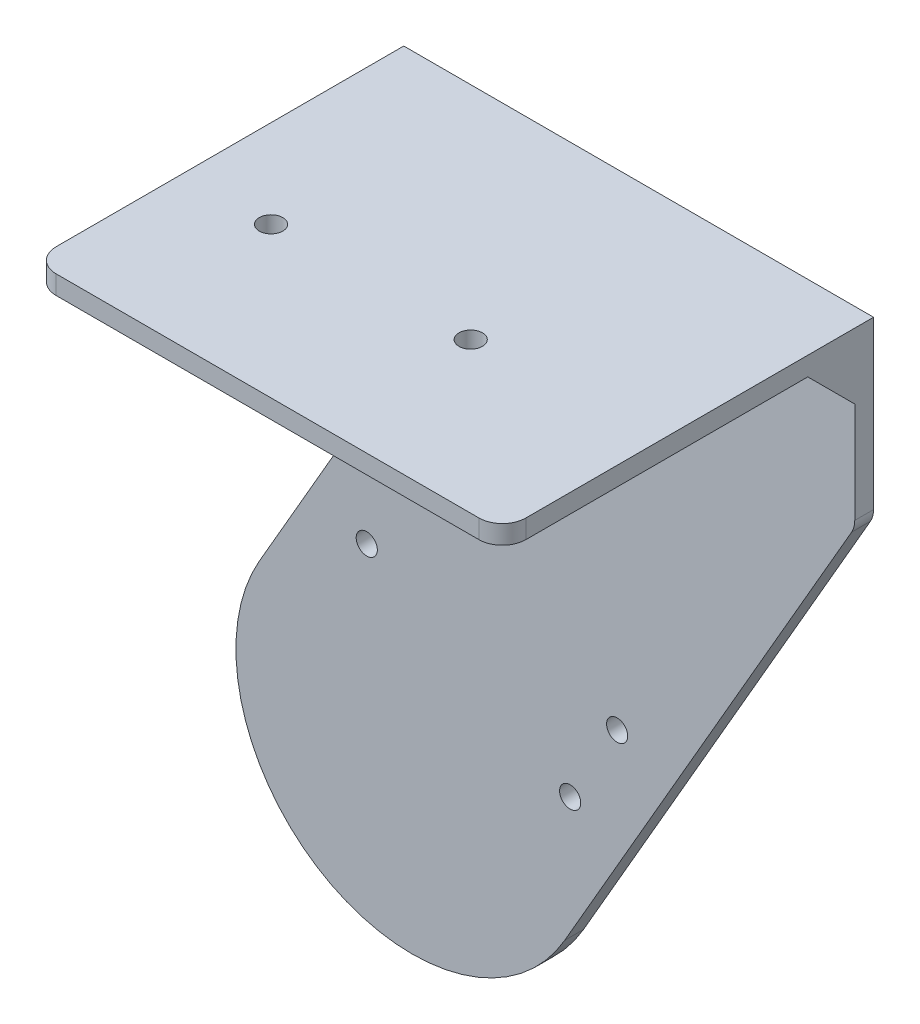
ISO-10303-21;
HEADER;
FILE_DESCRIPTION(('STEP AP214'),'2;1');
FILE_NAME('part.step','',(''),(''),'','','');
FILE_SCHEMA(('AUTOMOTIVE_DESIGN { 1 0 10303 214 1 1 1 1 }'));
ENDSEC;
DATA;
#1=APPLICATION_CONTEXT('core data for automotive mechanical design processes');
#2=APPLICATION_PROTOCOL_DEFINITION('international standard','automotive_design',2000,#1);
#3=PRODUCT_CONTEXT('',#1,'mechanical');
#4=PRODUCT('Part','Part','',(#3));
#5=PRODUCT_RELATED_PRODUCT_CATEGORY('part','',(#4));
#6=PRODUCT_DEFINITION_FORMATION('','',#4);
#7=PRODUCT_DEFINITION_CONTEXT('part definition',#1,'design');
#8=PRODUCT_DEFINITION('design','',#6,#7);
#9=PRODUCT_DEFINITION_SHAPE('','',#8);
#10=(LENGTH_UNIT() NAMED_UNIT(*) SI_UNIT(.MILLI.,.METRE.));
#11=(NAMED_UNIT(*) PLANE_ANGLE_UNIT() SI_UNIT($,.RADIAN.));
#12=(NAMED_UNIT(*) SI_UNIT($,.STERADIAN.) SOLID_ANGLE_UNIT());
#13=UNCERTAINTY_MEASURE_WITH_UNIT(LENGTH_MEASURE(1.E-05),#10,'distance_accuracy_value','');
#14=(GEOMETRIC_REPRESENTATION_CONTEXT(3) GLOBAL_UNCERTAINTY_ASSIGNED_CONTEXT((#13)) GLOBAL_UNIT_ASSIGNED_CONTEXT((#10,
#11,#12)) REPRESENTATION_CONTEXT('',''));
#15=CARTESIAN_POINT('',(0.,0.,0.));
#16=DIRECTION('',(0.,0.,1.));
#17=DIRECTION('',(1.,0.,0.));
#18=AXIS2_PLACEMENT_3D('',#15,#16,#17);
#19=CARTESIAN_POINT('',(0.,0.,8.));
#20=DIRECTION('',(0.,0.,-1.));
#21=DIRECTION('',(-1.,0.,0.));
#22=AXIS2_PLACEMENT_3D('',#19,#20,#21);
#23=CYLINDRICAL_SURFACE('',#22,75.);
#24=CARTESIAN_POINT('',(0.,0.,0.));
#25=DIRECTION('',(0.,0.,1.));
#26=DIRECTION('',(-1.,0.,0.));
#27=AXIS2_PLACEMENT_3D('',#24,#25,#26);
#28=CIRCLE('',#27,75.);
#29=CARTESIAN_POINT('',(-64.9519052838328,37.5,0.));
#30=VERTEX_POINT('',#29);
#31=CARTESIAN_POINT('',(64.9519052838328,-37.5000000000001,0.));
#32=VERTEX_POINT('',#31);
#33=EDGE_CURVE('E157',#30,#32,#28,.T.);
#34=ORIENTED_EDGE('',*,*,#33,.T.);
#35=DIRECTION('',(0.,0.,-1.));
#36=VECTOR('',#35,1.);
#37=CARTESIAN_POINT('',(64.9519052838328,-37.5000000000001,8.));
#38=LINE('',#37,#36);
#39=CARTESIAN_POINT('',(64.9519052838328,-37.5000000000001,8.));
#40=VERTEX_POINT('',#39);
#41=EDGE_CURVE('E138',#40,#32,#38,.T.);
#42=ORIENTED_EDGE('',*,*,#41,.F.);
#43=CARTESIAN_POINT('',(0.,0.,8.));
#44=DIRECTION('',(0.,0.,1.));
#45=DIRECTION('',(-1.,0.,0.));
#46=AXIS2_PLACEMENT_3D('',#43,#44,#45);
#47=CIRCLE('',#46,75.);
#48=CARTESIAN_POINT('',(-64.9519052838328,37.5,8.));
#49=VERTEX_POINT('',#48);
#50=EDGE_CURVE('E145',#49,#40,#47,.T.);
#51=ORIENTED_EDGE('',*,*,#50,.F.);
#52=DIRECTION('',(0.,0.,-1.));
#53=VECTOR('',#52,1.);
#54=CARTESIAN_POINT('',(-64.9519052838328,37.5,8.));
#55=LINE('',#54,#53);
#56=EDGE_CURVE('E225',#49,#30,#55,.T.);
#57=ORIENTED_EDGE('',*,*,#56,.T.);
#58=EDGE_LOOP('',(#34,#42,#51,#57));
#59=FACE_BOUND('',#58,.T.);
#60=ADVANCED_FACE('F36',(#59),#23,.T.);
#61=CARTESIAN_POINT('',(64.9519052838328,-37.5000000000001,8.));
#62=DIRECTION('',(-0.866025403784438,0.500000000000001,0.));
#63=DIRECTION('',(-0.500000000000001,-0.866025403784438,0.));
#64=AXIS2_PLACEMENT_3D('',#61,#62,#63);
#65=PLANE('',#64);
#66=DIRECTION('',(0.500000000000001,0.866025403784438,0.));
#67=VECTOR('',#66,1.);
#68=CARTESIAN_POINT('',(64.9519052838328,-37.5000000000001,0.));
#69=LINE('',#68,#67);
#70=CARTESIAN_POINT('',(187.113248654052,174.089653438086,0.));
#71=VERTEX_POINT('',#70);
#72=EDGE_CURVE('E232',#32,#71,#69,.T.);
#73=ORIENTED_EDGE('',*,*,#72,.T.);
#74=DIRECTION('',(0.,0.,-1.));
#75=VECTOR('',#74,1.);
#76=CARTESIAN_POINT('',(187.113248654052,174.089653438086,8.));
#77=LINE('',#76,#75);
#78=CARTESIAN_POINT('',(187.113248654052,174.089653438086,8.));
#79=VERTEX_POINT('',#78);
#80=EDGE_CURVE('E141',#71,#79,#77,.F.);
#81=ORIENTED_EDGE('',*,*,#80,.T.);
#82=DIRECTION('',(0.500000000000001,0.866025403784438,0.));
#83=VECTOR('',#82,1.);
#84=CARTESIAN_POINT('',(64.9519052838328,-37.5000000000001,8.));
#85=LINE('',#84,#83);
#86=EDGE_CURVE('E133',#40,#79,#85,.T.);
#87=ORIENTED_EDGE('',*,*,#86,.F.);
#88=ORIENTED_EDGE('',*,*,#41,.T.);
#89=EDGE_LOOP('',(#73,#81,#87,#88));
#90=FACE_BOUND('',#89,.T.);
#91=ADVANCED_FACE('F136',(#90),#65,.F.);
#92=CARTESIAN_POINT('',(188.452994616208,250.,8.));
#93=DIRECTION('',(-1.,0.,0.));
#94=DIRECTION('',(0.,0.,1.));
#95=AXIS2_PLACEMENT_3D('',#92,#93,#94);
#96=PLANE('',#95);
#97=DIRECTION('',(0.,1.,0.));
#98=VECTOR('',#97,1.);
#99=CARTESIAN_POINT('',(188.452994616208,250.,8.));
#100=LINE('',#99,#98);
#101=CARTESIAN_POINT('',(188.452994616208,179.089653438086,8.));
#102=VERTEX_POINT('',#101);
#103=CARTESIAN_POINT('',(188.452994616208,222.,8.));
#104=VERTEX_POINT('',#103);
#105=EDGE_CURVE('E144',#102,#104,#100,.T.);
#106=ORIENTED_EDGE('',*,*,#105,.F.);
#107=DIRECTION('',(0.,0.,-1.));
#108=VECTOR('',#107,1.);
#109=CARTESIAN_POINT('',(188.452994616208,179.089653438086,8.));
#110=LINE('',#109,#108);
#111=CARTESIAN_POINT('',(188.452994616208,179.089653438086,0.));
#112=VERTEX_POINT('',#111);
#113=EDGE_CURVE('E184',#102,#112,#110,.T.);
#114=ORIENTED_EDGE('',*,*,#113,.T.);
#115=DIRECTION('',(0.,1.,0.));
#116=VECTOR('',#115,1.);
#117=CARTESIAN_POINT('',(188.452994616208,250.,0.));
#118=LINE('',#117,#116);
#119=CARTESIAN_POINT('',(188.452994616208,250.,0.));
#120=VERTEX_POINT('',#119);
#121=EDGE_CURVE('E235',#112,#120,#118,.T.);
#122=ORIENTED_EDGE('',*,*,#121,.T.);
#123=DIRECTION('',(0.,0.,-1.));
#124=VECTOR('',#123,1.);
#125=CARTESIAN_POINT('',(188.452994616208,250.,8.));
#126=LINE('',#125,#124);
#127=CARTESIAN_POINT('',(188.452994616208,250.,148.));
#128=VERTEX_POINT('',#127);
#129=EDGE_CURVE('E159',#128,#120,#126,.T.);
#130=ORIENTED_EDGE('',*,*,#129,.F.);
#131=DIRECTION('',(0.,1.,0.));
#132=VECTOR('',#131,1.);
#133=CARTESIAN_POINT('',(188.452994616208,250.,148.));
#134=LINE('',#133,#132);
#135=CARTESIAN_POINT('',(188.452994616208,242.,148.));
#136=VERTEX_POINT('',#135);
#137=EDGE_CURVE('E182',#128,#136,#134,.F.);
#138=ORIENTED_EDGE('',*,*,#137,.T.);
#139=DIRECTION('',(0.,0.,1.));
#140=VECTOR('',#139,1.);
#141=CARTESIAN_POINT('',(188.452994616208,242.,0.));
#142=LINE('',#141,#140);
#143=CARTESIAN_POINT('',(188.452994616208,242.,28.));
#144=VERTEX_POINT('',#143);
#145=EDGE_CURVE('E233',#144,#136,#142,.T.);
#146=ORIENTED_EDGE('',*,*,#145,.F.);
#147=DIRECTION('',(0.,0.707106781186551,0.707106781186544));
#148=VECTOR('',#147,1.);
#149=CARTESIAN_POINT('',(188.452994616208,236.,22.0000000000001));
#150=LINE('',#149,#148);
#151=EDGE_CURVE('E172',#144,#104,#150,.F.);
#152=ORIENTED_EDGE('',*,*,#151,.T.);
#153=EDGE_LOOP('',(#106,#114,#122,#130,#138,#146,#152));
#154=FACE_BOUND('',#153,.T.);
#155=ADVANCED_FACE('F244',(#154),#96,.F.);
#156=CARTESIAN_POINT('',(-11.5470053837924,250.,8.));
#157=DIRECTION('',(0.,-1.,0.));
#158=DIRECTION('',(0.,0.,-1.));
#159=AXIS2_PLACEMENT_3D('',#156,#157,#158);
#160=PLANE('',#159);
#161=CARTESIAN_POINT('',(25.9529946162076,250.,94.));
#162=DIRECTION('',(0.,1.,0.));
#163=DIRECTION('',(0.,0.,1.));
#164=AXIS2_PLACEMENT_3D('',#161,#162,#163);
#165=CIRCLE('',#164,5.);
#166=CARTESIAN_POINT('',(25.9529946162076,250.,99.));
#167=VERTEX_POINT('',#166);
#168=EDGE_CURVE('E262',#167,#167,#165,.T.);
#169=ORIENTED_EDGE('',*,*,#168,.F.);
#170=EDGE_LOOP('',(#169));
#171=FACE_BOUND('',#170,.T.);
#172=CARTESIAN_POINT('',(110.952994616208,250.,94.));
#173=DIRECTION('',(0.,1.,0.));
#174=DIRECTION('',(0.,0.,1.));
#175=AXIS2_PLACEMENT_3D('',#172,#173,#174);
#176=CIRCLE('',#175,5.00000000000001);
#177=CARTESIAN_POINT('',(110.952994616208,250.,99.));
#178=VERTEX_POINT('',#177);
#179=EDGE_CURVE('E263',#178,#178,#176,.T.);
#180=ORIENTED_EDGE('',*,*,#179,.F.);
#181=EDGE_LOOP('',(#180));
#182=FACE_BOUND('',#181,.T.);
#183=DIRECTION('',(-1.,0.,0.));
#184=VECTOR('',#183,1.);
#185=CARTESIAN_POINT('',(338.666176461211,250.,158.));
#186=LINE('',#185,#184);
#187=CARTESIAN_POINT('',(178.452994616208,250.,158.));
#188=VERTEX_POINT('',#187);
#189=CARTESIAN_POINT('',(-1.54700538379238,250.,158.));
#190=VERTEX_POINT('',#189);
#191=EDGE_CURVE('E252',#188,#190,#186,.T.);
#192=ORIENTED_EDGE('',*,*,#191,.F.);
#193=CARTESIAN_POINT('',(178.452994616208,250.,148.));
#194=DIRECTION('',(0.,-1.,0.));
#195=DIRECTION('',(0.,0.,-1.));
#196=AXIS2_PLACEMENT_3D('',#193,#194,#195);
#197=CIRCLE('',#196,10.);
#198=EDGE_CURVE('E59',#188,#128,#197,.F.);
#199=ORIENTED_EDGE('',*,*,#198,.T.);
#200=ORIENTED_EDGE('',*,*,#129,.T.);
#201=DIRECTION('',(-1.,0.,0.));
#202=VECTOR('',#201,1.);
#203=CARTESIAN_POINT('',(-11.5470053837924,250.,0.));
#204=LINE('',#203,#202);
#205=CARTESIAN_POINT('',(-11.5470053837924,250.,0.));
#206=VERTEX_POINT('',#205);
#207=EDGE_CURVE('E218',#120,#206,#204,.T.);
#208=ORIENTED_EDGE('',*,*,#207,.T.);
#209=DIRECTION('',(0.,0.,-1.));
#210=VECTOR('',#209,1.);
#211=CARTESIAN_POINT('',(-11.5470053837924,250.,8.));
#212=LINE('',#211,#210);
#213=CARTESIAN_POINT('',(-11.5470053837924,250.,148.));
#214=VERTEX_POINT('',#213);
#215=EDGE_CURVE('E164',#214,#206,#212,.T.);
#216=ORIENTED_EDGE('',*,*,#215,.F.);
#217=CARTESIAN_POINT('',(-1.54700538379238,250.,148.));
#218=DIRECTION('',(0.,-1.,0.));
#219=DIRECTION('',(0.,0.,-1.));
#220=AXIS2_PLACEMENT_3D('',#217,#218,#219);
#221=CIRCLE('',#220,10.);
#222=EDGE_CURVE('E51',#214,#190,#221,.F.);
#223=ORIENTED_EDGE('',*,*,#222,.T.);
#224=EDGE_LOOP('',(#192,#199,#200,#208,#216,#223));
#225=FACE_BOUND('',#224,.T.);
#226=ADVANCED_FACE('F358',(#171,#182,#225),#160,.F.);
#227=CARTESIAN_POINT('',(-11.5470053837924,130.,8.));
#228=DIRECTION('',(1.,0.,0.));
#229=DIRECTION('',(0.,0.,-1.));
#230=AXIS2_PLACEMENT_3D('',#227,#228,#229);
#231=PLANE('',#230);
#232=DIRECTION('',(0.,-1.,0.));
#233=VECTOR('',#232,1.);
#234=CARTESIAN_POINT('',(-11.5470053837924,130.,0.));
#235=LINE('',#234,#233);
#236=CARTESIAN_POINT('',(-11.5470053837924,132.679491924311,0.));
#237=VERTEX_POINT('',#236);
#238=EDGE_CURVE('E209',#206,#237,#235,.T.);
#239=ORIENTED_EDGE('',*,*,#238,.T.);
#240=DIRECTION('',(0.,0.,-1.));
#241=VECTOR('',#240,1.);
#242=CARTESIAN_POINT('',(-11.5470053837924,132.679491924311,8.));
#243=LINE('',#242,#241);
#244=CARTESIAN_POINT('',(-11.5470053837924,132.679491924311,8.));
#245=VERTEX_POINT('',#244);
#246=EDGE_CURVE('E180',#237,#245,#243,.F.);
#247=ORIENTED_EDGE('',*,*,#246,.T.);
#248=DIRECTION('',(0.,-1.,0.));
#249=VECTOR('',#248,1.);
#250=CARTESIAN_POINT('',(-11.5470053837924,130.,8.));
#251=LINE('',#250,#249);
#252=CARTESIAN_POINT('',(-11.5470053837924,222.,8.));
#253=VERTEX_POINT('',#252);
#254=EDGE_CURVE('E222',#253,#245,#251,.T.);
#255=ORIENTED_EDGE('',*,*,#254,.F.);
#256=DIRECTION('',(0.,-0.707106781186551,-0.707106781186544));
#257=VECTOR('',#256,1.);
#258=CARTESIAN_POINT('',(-11.5470053837924,175.999999999999,-37.9999999999999));
#259=LINE('',#258,#257);
#260=CARTESIAN_POINT('',(-11.5470053837924,242.,28.));
#261=VERTEX_POINT('',#260);
#262=EDGE_CURVE('E169',#253,#261,#259,.F.);
#263=ORIENTED_EDGE('',*,*,#262,.T.);
#264=DIRECTION('',(0.,0.,-1.));
#265=VECTOR('',#264,1.);
#266=CARTESIAN_POINT('',(-11.5470053837924,242.,0.));
#267=LINE('',#266,#265);
#268=CARTESIAN_POINT('',(-11.5470053837924,242.,148.));
#269=VERTEX_POINT('',#268);
#270=EDGE_CURVE('E253',#269,#261,#267,.T.);
#271=ORIENTED_EDGE('',*,*,#270,.F.);
#272=DIRECTION('',(0.,-1.,0.));
#273=VECTOR('',#272,1.);
#274=CARTESIAN_POINT('',(-11.5470053837924,130.,148.));
#275=LINE('',#274,#273);
#276=EDGE_CURVE('E178',#269,#214,#275,.F.);
#277=ORIENTED_EDGE('',*,*,#276,.T.);
#278=ORIENTED_EDGE('',*,*,#215,.T.);
#279=EDGE_LOOP('',(#239,#247,#255,#263,#271,#277,#278));
#280=FACE_BOUND('',#279,.T.);
#281=ADVANCED_FACE('F214',(#280),#231,.F.);
#282=CARTESIAN_POINT('',(-64.9519052838328,37.5,8.));
#283=DIRECTION('',(0.866025403784438,-0.5,0.));
#284=DIRECTION('',(0.5,0.866025403784438,0.));
#285=AXIS2_PLACEMENT_3D('',#282,#283,#284);
#286=PLANE('',#285);
#287=DIRECTION('',(-0.5,-0.866025403784438,0.));
#288=VECTOR('',#287,1.);
#289=CARTESIAN_POINT('',(-64.9519052838328,37.5,8.));
#290=LINE('',#289,#288);
#291=CARTESIAN_POINT('',(-12.886751345948,127.679491924311,8.));
#292=VERTEX_POINT('',#291);
#293=EDGE_CURVE('E150',#292,#49,#290,.T.);
#294=ORIENTED_EDGE('',*,*,#293,.F.);
#295=DIRECTION('',(0.,0.,-1.));
#296=VECTOR('',#295,1.);
#297=CARTESIAN_POINT('',(-12.886751345948,127.679491924311,0.));
#298=LINE('',#297,#296);
#299=CARTESIAN_POINT('',(-12.886751345948,127.679491924311,0.));
#300=VERTEX_POINT('',#299);
#301=EDGE_CURVE('E175',#292,#300,#298,.T.);
#302=ORIENTED_EDGE('',*,*,#301,.T.);
#303=DIRECTION('',(-0.5,-0.866025403784438,0.));
#304=VECTOR('',#303,1.);
#305=CARTESIAN_POINT('',(-64.9519052838328,37.5,0.));
#306=LINE('',#305,#304);
#307=EDGE_CURVE('E154',#300,#30,#306,.T.);
#308=ORIENTED_EDGE('',*,*,#307,.T.);
#309=ORIENTED_EDGE('',*,*,#56,.F.);
#310=EDGE_LOOP('',(#294,#302,#308,#309));
#311=FACE_BOUND('',#310,.T.);
#312=ADVANCED_FACE('F224',(#311),#286,.F.);
#313=CARTESIAN_POINT('',(0.,0.,8.));
#314=DIRECTION('',(0.,0.,-1.));
#315=DIRECTION('',(-1.,0.,0.));
#316=AXIS2_PLACEMENT_3D('',#313,#314,#315);
#317=PLANE('',#316);
#318=CARTESIAN_POINT('',(0.698729810778101,101.210235533031,8.));
#319=DIRECTION('',(0.,0.,1.));
#320=DIRECTION('',(1.,0.,0.));
#321=AXIS2_PLACEMENT_3D('',#318,#319,#320);
#322=CIRCLE('',#321,4.5);
#323=CARTESIAN_POINT('',(5.1987298107781,101.210235533031,8.));
#324=VERTEX_POINT('',#323);
#325=EDGE_CURVE('E266',#324,#324,#322,.T.);
#326=ORIENTED_EDGE('',*,*,#325,.F.);
#327=EDGE_LOOP('',(#326));
#328=FACE_BOUND('',#327,.T.);
#329=CARTESIAN_POINT('',(87.301270189222,51.2102355330306,8.));
#330=DIRECTION('',(0.,0.,1.));
#331=DIRECTION('',(1.,0.,0.));
#332=AXIS2_PLACEMENT_3D('',#329,#330,#331);
#333=CIRCLE('',#332,4.50000000000001);
#334=CARTESIAN_POINT('',(91.801270189222,51.2102355330306,8.));
#335=VERTEX_POINT('',#334);
#336=EDGE_CURVE('E286',#335,#335,#333,.T.);
#337=ORIENTED_EDGE('',*,*,#336,.F.);
#338=EDGE_LOOP('',(#337));
#339=FACE_BOUND('',#338,.T.);
#340=CARTESIAN_POINT('',(67.301270189222,16.569219381653,8.));
#341=DIRECTION('',(0.,0.,1.));
#342=DIRECTION('',(1.,0.,0.));
#343=AXIS2_PLACEMENT_3D('',#340,#341,#342);
#344=CIRCLE('',#343,4.5);
#345=CARTESIAN_POINT('',(71.801270189222,16.569219381653,8.));
#346=VERTEX_POINT('',#345);
#347=EDGE_CURVE('E280',#346,#346,#344,.T.);
#348=ORIENTED_EDGE('',*,*,#347,.F.);
#349=EDGE_LOOP('',(#348));
#350=FACE_BOUND('',#349,.T.);
#351=CARTESIAN_POINT('',(-19.3012701892219,66.569219381653,8.));
#352=DIRECTION('',(0.,0.,1.));
#353=DIRECTION('',(1.,0.,0.));
#354=AXIS2_PLACEMENT_3D('',#351,#352,#353);
#355=CIRCLE('',#354,4.5);
#356=CARTESIAN_POINT('',(-14.8012701892219,66.569219381653,8.));
#357=VERTEX_POINT('',#356);
#358=EDGE_CURVE('E274',#357,#357,#355,.T.);
#359=ORIENTED_EDGE('',*,*,#358,.F.);
#360=EDGE_LOOP('',(#359));
#361=FACE_BOUND('',#360,.T.);
#362=ORIENTED_EDGE('',*,*,#86,.T.);
#363=CARTESIAN_POINT('',(178.452994616208,179.089653438086,8.));
#364=DIRECTION('',(0.,0.,-1.));
#365=DIRECTION('',(-1.,0.,0.));
#366=AXIS2_PLACEMENT_3D('',#363,#364,#365);
#367=CIRCLE('',#366,10.);
#368=EDGE_CURVE('E190',#79,#102,#367,.F.);
#369=ORIENTED_EDGE('',*,*,#368,.T.);
#370=ORIENTED_EDGE('',*,*,#105,.T.);
#371=DIRECTION('',(-1.,0.,0.));
#372=VECTOR('',#371,1.);
#373=CARTESIAN_POINT('',(-11.5470053837924,222.,8.));
#374=LINE('',#373,#372);
#375=EDGE_CURVE('E158',#104,#253,#374,.T.);
#376=ORIENTED_EDGE('',*,*,#375,.T.);
#377=ORIENTED_EDGE('',*,*,#254,.T.);
#378=CARTESIAN_POINT('',(-21.5470053837924,132.679491924311,8.));
#379=DIRECTION('',(0.,0.,-1.));
#380=DIRECTION('',(-1.,0.,0.));
#381=AXIS2_PLACEMENT_3D('',#378,#379,#380);
#382=CIRCLE('',#381,10.);
#383=EDGE_CURVE('E11',#245,#292,#382,.T.);
#384=ORIENTED_EDGE('',*,*,#383,.T.);
#385=ORIENTED_EDGE('',*,*,#293,.T.);
#386=ORIENTED_EDGE('',*,*,#50,.T.);
#387=EDGE_LOOP('',(#362,#369,#370,#376,#377,#384,#385,#386));
#388=FACE_BOUND('',#387,.T.);
#389=ADVANCED_FACE('F148',(#328,#339,#350,#361,#388),#317,.F.);
#390=CARTESIAN_POINT('',(0.,0.,0.));
#391=DIRECTION('',(0.,0.,-1.));
#392=DIRECTION('',(-1.,0.,0.));
#393=AXIS2_PLACEMENT_3D('',#390,#391,#392);
#394=PLANE('',#393);
#395=CARTESIAN_POINT('',(0.698729810778101,101.210235533031,0.));
#396=DIRECTION('',(0.,0.,-1.));
#397=DIRECTION('',(-1.,0.,0.));
#398=AXIS2_PLACEMENT_3D('',#395,#396,#397);
#399=CIRCLE('',#398,4.5);
#400=CARTESIAN_POINT('',(-3.8012701892219,101.210235533031,0.));
#401=VERTEX_POINT('',#400);
#402=EDGE_CURVE('E289',#401,#401,#399,.F.);
#403=ORIENTED_EDGE('',*,*,#402,.T.);
#404=EDGE_LOOP('',(#403));
#405=FACE_BOUND('',#404,.T.);
#406=CARTESIAN_POINT('',(87.301270189222,51.2102355330306,0.));
#407=DIRECTION('',(0.,0.,-1.));
#408=DIRECTION('',(-1.,0.,0.));
#409=AXIS2_PLACEMENT_3D('',#406,#407,#408);
#410=CIRCLE('',#409,4.50000000000001);
#411=CARTESIAN_POINT('',(82.801270189222,51.2102355330306,0.));
#412=VERTEX_POINT('',#411);
#413=EDGE_CURVE('E283',#412,#412,#410,.F.);
#414=ORIENTED_EDGE('',*,*,#413,.T.);
#415=EDGE_LOOP('',(#414));
#416=FACE_BOUND('',#415,.T.);
#417=CARTESIAN_POINT('',(67.301270189222,16.569219381653,0.));
#418=DIRECTION('',(0.,0.,-1.));
#419=DIRECTION('',(-1.,0.,0.));
#420=AXIS2_PLACEMENT_3D('',#417,#418,#419);
#421=CIRCLE('',#420,4.5);
#422=CARTESIAN_POINT('',(62.801270189222,16.569219381653,0.));
#423=VERTEX_POINT('',#422);
#424=EDGE_CURVE('E277',#423,#423,#421,.F.);
#425=ORIENTED_EDGE('',*,*,#424,.T.);
#426=EDGE_LOOP('',(#425));
#427=FACE_BOUND('',#426,.T.);
#428=CARTESIAN_POINT('',(-19.3012701892219,66.569219381653,0.));
#429=DIRECTION('',(0.,0.,-1.));
#430=DIRECTION('',(-1.,0.,0.));
#431=AXIS2_PLACEMENT_3D('',#428,#429,#430);
#432=CIRCLE('',#431,4.5);
#433=CARTESIAN_POINT('',(-23.8012701892219,66.569219381653,0.));
#434=VERTEX_POINT('',#433);
#435=EDGE_CURVE('E271',#434,#434,#432,.F.);
#436=ORIENTED_EDGE('',*,*,#435,.T.);
#437=EDGE_LOOP('',(#436));
#438=FACE_BOUND('',#437,.T.);
#439=ORIENTED_EDGE('',*,*,#121,.F.);
#440=CARTESIAN_POINT('',(178.452994616208,179.089653438086,0.));
#441=DIRECTION('',(0.,0.,-1.));
#442=DIRECTION('',(-1.,0.,0.));
#443=AXIS2_PLACEMENT_3D('',#440,#441,#442);
#444=CIRCLE('',#443,10.);
#445=EDGE_CURVE('E187',#112,#71,#444,.T.);
#446=ORIENTED_EDGE('',*,*,#445,.T.);
#447=ORIENTED_EDGE('',*,*,#72,.F.);
#448=ORIENTED_EDGE('',*,*,#33,.F.);
#449=ORIENTED_EDGE('',*,*,#307,.F.);
#450=CARTESIAN_POINT('',(-21.5470053837924,132.679491924311,0.));
#451=DIRECTION('',(0.,0.,-1.));
#452=DIRECTION('',(-1.,0.,0.));
#453=AXIS2_PLACEMENT_3D('',#450,#451,#452);
#454=CIRCLE('',#453,10.);
#455=EDGE_CURVE('E44',#300,#237,#454,.F.);
#456=ORIENTED_EDGE('',*,*,#455,.T.);
#457=ORIENTED_EDGE('',*,*,#238,.F.);
#458=ORIENTED_EDGE('',*,*,#207,.F.);
#459=EDGE_LOOP('',(#439,#446,#447,#448,#449,#456,#457,#458));
#460=FACE_BOUND('',#459,.T.);
#461=ADVANCED_FACE('F207',(#405,#416,#427,#438,#460),#394,.T.);
#462=CARTESIAN_POINT('',(338.666176461211,0.,158.));
#463=DIRECTION('',(0.,0.,-1.));
#464=DIRECTION('',(-1.,0.,0.));
#465=AXIS2_PLACEMENT_3D('',#462,#463,#464);
#466=PLANE('',#465);
#467=DIRECTION('',(-1.,0.,0.));
#468=VECTOR('',#467,1.);
#469=CARTESIAN_POINT('',(338.666176461211,242.,158.));
#470=LINE('',#469,#468);
#471=CARTESIAN_POINT('',(178.452994616208,242.,158.));
#472=VERTEX_POINT('',#471);
#473=CARTESIAN_POINT('',(-1.54700538379238,242.,158.));
#474=VERTEX_POINT('',#473);
#475=EDGE_CURVE('E249',#472,#474,#470,.T.);
#476=ORIENTED_EDGE('',*,*,#475,.F.);
#477=DIRECTION('',(0.,1.,0.));
#478=VECTOR('',#477,1.);
#479=CARTESIAN_POINT('',(178.452994616208,0.,158.));
#480=LINE('',#479,#478);
#481=EDGE_CURVE('E195',#472,#188,#480,.T.);
#482=ORIENTED_EDGE('',*,*,#481,.T.);
#483=ORIENTED_EDGE('',*,*,#191,.T.);
#484=DIRECTION('',(0.,-1.,0.));
#485=VECTOR('',#484,1.);
#486=CARTESIAN_POINT('',(-1.54700538379238,0.,158.));
#487=LINE('',#486,#485);
#488=EDGE_CURVE('E192',#190,#474,#487,.T.);
#489=ORIENTED_EDGE('',*,*,#488,.T.);
#490=EDGE_LOOP('',(#476,#482,#483,#489));
#491=FACE_BOUND('',#490,.T.);
#492=ADVANCED_FACE('F352',(#491),#466,.F.);
#493=CARTESIAN_POINT('',(338.666176461211,242.,0.));
#494=DIRECTION('',(0.,1.,0.));
#495=DIRECTION('',(0.,0.,1.));
#496=AXIS2_PLACEMENT_3D('',#493,#494,#495);
#497=PLANE('',#496);
#498=CARTESIAN_POINT('',(25.9529946162076,242.,94.));
#499=DIRECTION('',(0.,1.,0.));
#500=DIRECTION('',(0.,0.,1.));
#501=AXIS2_PLACEMENT_3D('',#498,#499,#500);
#502=CIRCLE('',#501,5.);
#503=CARTESIAN_POINT('',(25.9529946162076,242.,99.));
#504=VERTEX_POINT('',#503);
#505=EDGE_CURVE('E256',#504,#504,#502,.F.);
#506=ORIENTED_EDGE('',*,*,#505,.F.);
#507=EDGE_LOOP('',(#506));
#508=FACE_BOUND('',#507,.T.);
#509=CARTESIAN_POINT('',(110.952994616208,242.,94.));
#510=DIRECTION('',(0.,1.,0.));
#511=DIRECTION('',(0.,0.,1.));
#512=AXIS2_PLACEMENT_3D('',#509,#510,#511);
#513=CIRCLE('',#512,5.00000000000001);
#514=CARTESIAN_POINT('',(110.952994616208,242.,99.));
#515=VERTEX_POINT('',#514);
#516=EDGE_CURVE('E259',#515,#515,#513,.F.);
#517=ORIENTED_EDGE('',*,*,#516,.F.);
#518=EDGE_LOOP('',(#517));
#519=FACE_BOUND('',#518,.T.);
#520=ORIENTED_EDGE('',*,*,#145,.T.);
#521=CARTESIAN_POINT('',(178.452994616208,242.,148.));
#522=DIRECTION('',(0.,1.,0.));
#523=DIRECTION('',(0.,0.,1.));
#524=AXIS2_PLACEMENT_3D('',#521,#522,#523);
#525=CIRCLE('',#524,10.);
#526=EDGE_CURVE('E201',#136,#472,#525,.F.);
#527=ORIENTED_EDGE('',*,*,#526,.T.);
#528=ORIENTED_EDGE('',*,*,#475,.T.);
#529=CARTESIAN_POINT('',(-1.54700538379238,242.,148.));
#530=DIRECTION('',(0.,1.,0.));
#531=DIRECTION('',(0.,0.,1.));
#532=AXIS2_PLACEMENT_3D('',#529,#530,#531);
#533=CIRCLE('',#532,10.);
#534=EDGE_CURVE('E199',#474,#269,#533,.F.);
#535=ORIENTED_EDGE('',*,*,#534,.T.);
#536=ORIENTED_EDGE('',*,*,#270,.T.);
#537=DIRECTION('',(1.,0.,0.));
#538=VECTOR('',#537,1.);
#539=CARTESIAN_POINT('',(188.452994616208,242.,28.));
#540=LINE('',#539,#538);
#541=EDGE_CURVE('E162',#261,#144,#540,.T.);
#542=ORIENTED_EDGE('',*,*,#541,.T.);
#543=EDGE_LOOP('',(#520,#527,#528,#535,#536,#542));
#544=FACE_BOUND('',#543,.T.);
#545=ADVANCED_FACE('F337',(#508,#519,#544),#497,.F.);
#546=CARTESIAN_POINT('',(0.,222.,8.));
#547=DIRECTION('',(0.,-0.707106781186543,0.707106781186551));
#548=DIRECTION('',(1.,0.,0.));
#549=AXIS2_PLACEMENT_3D('',#546,#547,#548);
#550=PLANE('',#549);
#551=ORIENTED_EDGE('',*,*,#151,.F.);
#552=ORIENTED_EDGE('',*,*,#541,.F.);
#553=ORIENTED_EDGE('',*,*,#262,.F.);
#554=ORIENTED_EDGE('',*,*,#375,.F.);
#555=EDGE_LOOP('',(#551,#552,#553,#554));
#556=FACE_BOUND('',#555,.T.);
#557=ADVANCED_FACE('F332',(#556),#550,.T.);
#558=CARTESIAN_POINT('',(110.952994616208,-75.001,94.));
#559=DIRECTION('',(0.,1.,0.));
#560=DIRECTION('',(0.,0.,1.));
#561=AXIS2_PLACEMENT_3D('',#558,#559,#560);
#562=CYLINDRICAL_SURFACE('',#561,5.00000000000001);
#563=ORIENTED_EDGE('',*,*,#179,.T.);
#564=EDGE_LOOP('',(#563));
#565=FACE_BOUND('',#564,.T.);
#566=ORIENTED_EDGE('',*,*,#516,.T.);
#567=EDGE_LOOP('',(#566));
#568=FACE_BOUND('',#567,.T.);
#569=ADVANCED_FACE('F319',(#565,#568),#562,.F.);
#570=CARTESIAN_POINT('',(25.9529946162076,-75.001,94.));
#571=DIRECTION('',(0.,1.,0.));
#572=DIRECTION('',(0.,0.,1.));
#573=AXIS2_PLACEMENT_3D('',#570,#571,#572);
#574=CYLINDRICAL_SURFACE('',#573,5.);
#575=ORIENTED_EDGE('',*,*,#168,.T.);
#576=EDGE_LOOP('',(#575));
#577=FACE_BOUND('',#576,.T.);
#578=ORIENTED_EDGE('',*,*,#505,.T.);
#579=EDGE_LOOP('',(#578));
#580=FACE_BOUND('',#579,.T.);
#581=ADVANCED_FACE('F309',(#577,#580),#574,.F.);
#582=CARTESIAN_POINT('',(-19.3012701892219,66.569219381653,-0.000999999999999265));
#583=DIRECTION('',(0.,0.,1.));
#584=DIRECTION('',(1.,0.,0.));
#585=AXIS2_PLACEMENT_3D('',#582,#583,#584);
#586=CYLINDRICAL_SURFACE('',#585,4.5);
#587=ORIENTED_EDGE('',*,*,#435,.F.);
#588=EDGE_LOOP('',(#587));
#589=FACE_BOUND('',#588,.T.);
#590=ORIENTED_EDGE('',*,*,#358,.T.);
#591=EDGE_LOOP('',(#590));
#592=FACE_BOUND('',#591,.T.);
#593=ADVANCED_FACE('F306',(#589,#592),#586,.F.);
#594=CARTESIAN_POINT('',(67.301270189222,16.569219381653,-0.000999999999999265));
#595=DIRECTION('',(0.,0.,1.));
#596=DIRECTION('',(1.,0.,0.));
#597=AXIS2_PLACEMENT_3D('',#594,#595,#596);
#598=CYLINDRICAL_SURFACE('',#597,4.5);
#599=ORIENTED_EDGE('',*,*,#424,.F.);
#600=EDGE_LOOP('',(#599));
#601=FACE_BOUND('',#600,.T.);
#602=ORIENTED_EDGE('',*,*,#347,.T.);
#603=EDGE_LOOP('',(#602));
#604=FACE_BOUND('',#603,.T.);
#605=ADVANCED_FACE('F308',(#601,#604),#598,.F.);
#606=CARTESIAN_POINT('',(87.301270189222,51.2102355330306,-0.000999999999999265));
#607=DIRECTION('',(0.,0.,1.));
#608=DIRECTION('',(1.,0.,0.));
#609=AXIS2_PLACEMENT_3D('',#606,#607,#608);
#610=CYLINDRICAL_SURFACE('',#609,4.50000000000001);
#611=ORIENTED_EDGE('',*,*,#413,.F.);
#612=EDGE_LOOP('',(#611));
#613=FACE_BOUND('',#612,.T.);
#614=ORIENTED_EDGE('',*,*,#336,.T.);
#615=EDGE_LOOP('',(#614));
#616=FACE_BOUND('',#615,.T.);
#617=ADVANCED_FACE('F316',(#613,#616),#610,.F.);
#618=CARTESIAN_POINT('',(0.698729810778101,101.210235533031,-0.000999999999999265));
#619=DIRECTION('',(0.,0.,1.));
#620=DIRECTION('',(1.,0.,0.));
#621=AXIS2_PLACEMENT_3D('',#618,#619,#620);
#622=CYLINDRICAL_SURFACE('',#621,4.5);
#623=ORIENTED_EDGE('',*,*,#402,.F.);
#624=EDGE_LOOP('',(#623));
#625=FACE_BOUND('',#624,.T.);
#626=ORIENTED_EDGE('',*,*,#325,.T.);
#627=EDGE_LOOP('',(#626));
#628=FACE_BOUND('',#627,.T.);
#629=ADVANCED_FACE('F295',(#625,#628),#622,.F.);
#630=CARTESIAN_POINT('',(-21.5470053837924,132.679491924311,8.));
#631=DIRECTION('',(0.,0.,1.));
#632=DIRECTION('',(1.,0.,0.));
#633=AXIS2_PLACEMENT_3D('',#630,#631,#632);
#634=CYLINDRICAL_SURFACE('',#633,10.);
#635=ORIENTED_EDGE('',*,*,#383,.F.);
#636=ORIENTED_EDGE('',*,*,#246,.F.);
#637=ORIENTED_EDGE('',*,*,#455,.F.);
#638=ORIENTED_EDGE('',*,*,#301,.F.);
#639=EDGE_LOOP('',(#635,#636,#637,#638));
#640=FACE_BOUND('',#639,.T.);
#641=ADVANCED_FACE('F221',(#640),#634,.F.);
#642=CARTESIAN_POINT('',(178.452994616208,179.089653438086,8.));
#643=DIRECTION('',(0.,0.,-1.));
#644=DIRECTION('',(-1.,0.,0.));
#645=AXIS2_PLACEMENT_3D('',#642,#643,#644);
#646=CYLINDRICAL_SURFACE('',#645,10.);
#647=ORIENTED_EDGE('',*,*,#368,.F.);
#648=ORIENTED_EDGE('',*,*,#80,.F.);
#649=ORIENTED_EDGE('',*,*,#445,.F.);
#650=ORIENTED_EDGE('',*,*,#113,.F.);
#651=EDGE_LOOP('',(#647,#648,#649,#650));
#652=FACE_BOUND('',#651,.T.);
#653=ADVANCED_FACE('F240',(#652),#646,.T.);
#654=CARTESIAN_POINT('',(178.452994616208,0.,148.));
#655=DIRECTION('',(0.,1.,0.));
#656=DIRECTION('',(0.,0.,1.));
#657=AXIS2_PLACEMENT_3D('',#654,#655,#656);
#658=CYLINDRICAL_SURFACE('',#657,10.);
#659=ORIENTED_EDGE('',*,*,#526,.F.);
#660=ORIENTED_EDGE('',*,*,#137,.F.);
#661=ORIENTED_EDGE('',*,*,#198,.F.);
#662=ORIENTED_EDGE('',*,*,#481,.F.);
#663=EDGE_LOOP('',(#659,#660,#661,#662));
#664=FACE_BOUND('',#663,.T.);
#665=ADVANCED_FACE('F342',(#664),#658,.T.);
#666=CARTESIAN_POINT('',(-1.54700538379238,0.,148.));
#667=DIRECTION('',(0.,-1.,0.));
#668=DIRECTION('',(0.,0.,-1.));
#669=AXIS2_PLACEMENT_3D('',#666,#667,#668);
#670=CYLINDRICAL_SURFACE('',#669,10.);
#671=ORIENTED_EDGE('',*,*,#222,.F.);
#672=ORIENTED_EDGE('',*,*,#276,.F.);
#673=ORIENTED_EDGE('',*,*,#534,.F.);
#674=ORIENTED_EDGE('',*,*,#488,.F.);
#675=EDGE_LOOP('',(#671,#672,#673,#674));
#676=FACE_BOUND('',#675,.T.);
#677=ADVANCED_FACE('F38',(#676),#670,.T.);
#678=CLOSED_SHELL('',(#60,#91,#155,#226,#281,#312,#389,#461,#492,#545,#557,#569,#581,#593,#605,
#617,#629,#641,#653,#665,#677));
#679=MANIFOLD_SOLID_BREP('B2',#678);
#680=ADVANCED_BREP_SHAPE_REPRESENTATION('',(#18,#679),#14);
#681=SHAPE_DEFINITION_REPRESENTATION(#9,#680);
ENDSEC;
END-ISO-10303-21;
